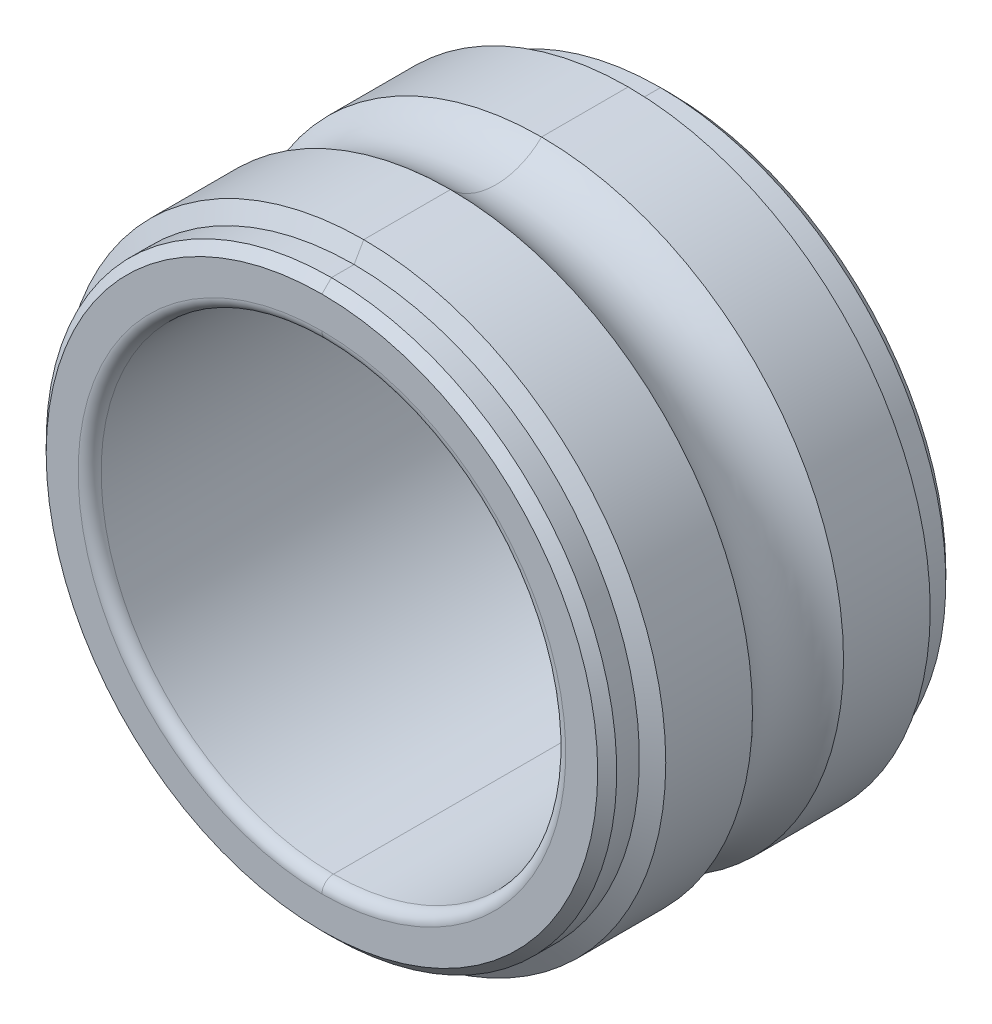
ISO-10303-21;
HEADER;
FILE_DESCRIPTION(('STEP AP214'),'2;1');
FILE_NAME('part.step','',(''),(''),'','','');
FILE_SCHEMA(('AUTOMOTIVE_DESIGN { 1 0 10303 214 1 1 1 1 }'));
ENDSEC;
DATA;
#1=APPLICATION_CONTEXT('core data for automotive mechanical design processes');
#2=APPLICATION_PROTOCOL_DEFINITION('international standard','automotive_design',2000,#1);
#3=PRODUCT_CONTEXT('',#1,'mechanical');
#4=PRODUCT('Part','Part','',(#3));
#5=PRODUCT_RELATED_PRODUCT_CATEGORY('part','',(#4));
#6=PRODUCT_DEFINITION_FORMATION('','',#4);
#7=PRODUCT_DEFINITION_CONTEXT('part definition',#1,'design');
#8=PRODUCT_DEFINITION('design','',#6,#7);
#9=PRODUCT_DEFINITION_SHAPE('','',#8);
#10=(LENGTH_UNIT() NAMED_UNIT(*) SI_UNIT(.MILLI.,.METRE.));
#11=(NAMED_UNIT(*) PLANE_ANGLE_UNIT() SI_UNIT($,.RADIAN.));
#12=(NAMED_UNIT(*) SI_UNIT($,.STERADIAN.) SOLID_ANGLE_UNIT());
#13=UNCERTAINTY_MEASURE_WITH_UNIT(LENGTH_MEASURE(1.E-05),#10,'distance_accuracy_value','');
#14=(GEOMETRIC_REPRESENTATION_CONTEXT(3) GLOBAL_UNCERTAINTY_ASSIGNED_CONTEXT((#13)) GLOBAL_UNIT_ASSIGNED_CONTEXT((#10,
#11,#12)) REPRESENTATION_CONTEXT('',''));
#15=CARTESIAN_POINT('',(0.,0.,0.));
#16=DIRECTION('',(0.,0.,1.));
#17=DIRECTION('',(1.,0.,0.));
#18=AXIS2_PLACEMENT_3D('',#15,#16,#17);
#19=CARTESIAN_POINT('',(0.,0.,1.39954));
#20=DIRECTION('',(0.,0.,-1.));
#21=DIRECTION('',(-0.00244616399090297,-0.999997008136389,0.));
#22=AXIS2_PLACEMENT_3D('',#19,#20,#21);
#23=TOROIDAL_SURFACE('',#22,2.09931,0.09906);
#24=CARTESIAN_POINT('',(0.,-2.09931,1.39954));
#25=DIRECTION('',(-1.,1.30283804578024E-13,0.));
#26=DIRECTION('',(0.,0.,1.));
#27=AXIS2_PLACEMENT_3D('',#24,#25,#26);
#28=CIRCLE('',#27,0.09906);
#29=CARTESIAN_POINT('',(0.,-2.09931,1.4986));
#30=VERTEX_POINT('',#29);
#31=CARTESIAN_POINT('',(0.,-2.00025,1.39954));
#32=VERTEX_POINT('',#31);
#33=EDGE_CURVE('E19',#30,#32,#28,.T.);
#34=ORIENTED_EDGE('',*,*,#33,.F.);
#35=CARTESIAN_POINT('',(0.,0.,1.4986));
#36=DIRECTION('',(0.,0.,1.));
#37=DIRECTION('',(0.,-1.,0.));
#38=AXIS2_PLACEMENT_3D('',#35,#36,#37);
#39=CIRCLE('',#38,2.09931);
#40=CARTESIAN_POINT('',(0.00513525652774209,2.0993037191508,1.4986));
#41=VERTEX_POINT('',#40);
#42=EDGE_CURVE('E166',#30,#41,#39,.T.);
#43=ORIENTED_EDGE('',*,*,#42,.T.);
#44=CARTESIAN_POINT('',(0.,0.,1.4986));
#45=DIRECTION('',(0.,0.,-1.));
#46=DIRECTION('',(0.,1.,0.));
#47=AXIS2_PLACEMENT_3D('',#44,#45,#46);
#48=CIRCLE('',#47,2.09931);
#49=CARTESIAN_POINT('',(0.,2.09931,1.4986));
#50=VERTEX_POINT('',#49);
#51=EDGE_CURVE('E159',#50,#41,#48,.T.);
#52=ORIENTED_EDGE('',*,*,#51,.F.);
#53=CARTESIAN_POINT('',(0.,2.09931,1.39954));
#54=DIRECTION('',(1.,-1.27619269318924E-13,0.));
#55=DIRECTION('',(0.,0.,1.));
#56=AXIS2_PLACEMENT_3D('',#53,#54,#55);
#57=CIRCLE('',#56,0.09906);
#58=CARTESIAN_POINT('',(0.,2.00025,1.39954));
#59=VERTEX_POINT('',#58);
#60=EDGE_CURVE('E11',#50,#59,#57,.T.);
#61=ORIENTED_EDGE('',*,*,#60,.T.);
#62=CARTESIAN_POINT('',(0.,0.,1.39954));
#63=DIRECTION('',(0.,0.,1.));
#64=DIRECTION('',(0.00244616399090244,0.999997008136389,0.));
#65=AXIS2_PLACEMENT_3D('',#62,#63,#64);
#66=CIRCLE('',#65,2.00025);
#67=CARTESIAN_POINT('',(0.00489293952280302,2.00024401552481,1.39954));
#68=VERTEX_POINT('',#67);
#69=EDGE_CURVE('E38',#68,#59,#66,.T.);
#70=ORIENTED_EDGE('',*,*,#69,.F.);
#71=CARTESIAN_POINT('',(0.,0.,1.39954));
#72=DIRECTION('',(0.,0.,1.));
#73=DIRECTION('',(0.,-1.,0.));
#74=AXIS2_PLACEMENT_3D('',#71,#72,#73);
#75=CIRCLE('',#74,2.00025);
#76=EDGE_CURVE('E289',#32,#68,#75,.T.);
#77=ORIENTED_EDGE('',*,*,#76,.F.);
#78=EDGE_LOOP('',(#34,#43,#52,#61,#70,#77));
#79=FACE_BOUND('',#78,.T.);
#80=ADVANCED_FACE('F16',(#79),#23,.T.);
#81=CARTESIAN_POINT('',(0.,0.,1.39954));
#82=DIRECTION('',(0.,0.,-1.));
#83=DIRECTION('',(0.00244616399090297,0.999997008136389,0.));
#84=AXIS2_PLACEMENT_3D('',#81,#82,#83);
#85=TOROIDAL_SURFACE('',#84,2.09931,0.09906);
#86=ORIENTED_EDGE('',*,*,#60,.F.);
#87=CARTESIAN_POINT('',(0.,0.,1.4986));
#88=DIRECTION('',(0.,0.,1.));
#89=DIRECTION('',(0.,1.,0.));
#90=AXIS2_PLACEMENT_3D('',#87,#88,#89);
#91=CIRCLE('',#90,2.09931);
#92=CARTESIAN_POINT('',(-0.00513525652774209,-2.0993037191508,1.4986));
#93=VERTEX_POINT('',#92);
#94=EDGE_CURVE('E153',#50,#93,#91,.T.);
#95=ORIENTED_EDGE('',*,*,#94,.T.);
#96=CARTESIAN_POINT('',(0.,0.,1.4986));
#97=DIRECTION('',(0.,0.,-1.));
#98=DIRECTION('',(0.,-1.,0.));
#99=AXIS2_PLACEMENT_3D('',#96,#97,#98);
#100=CIRCLE('',#99,2.09931);
#101=EDGE_CURVE('E165',#30,#93,#100,.T.);
#102=ORIENTED_EDGE('',*,*,#101,.F.);
#103=ORIENTED_EDGE('',*,*,#33,.T.);
#104=CARTESIAN_POINT('',(0.,0.,1.39954));
#105=DIRECTION('',(0.,0.,1.));
#106=DIRECTION('',(-0.00244616399090269,-0.999997008136389,0.));
#107=AXIS2_PLACEMENT_3D('',#104,#105,#106);
#108=CIRCLE('',#107,2.00025);
#109=CARTESIAN_POINT('',(-0.00489293952280326,-2.00024401552481,1.39954));
#110=VERTEX_POINT('',#109);
#111=EDGE_CURVE('E31',#110,#32,#108,.T.);
#112=ORIENTED_EDGE('',*,*,#111,.F.);
#113=CARTESIAN_POINT('',(0.,0.,1.39954));
#114=DIRECTION('',(0.,0.,1.));
#115=DIRECTION('',(0.,1.,0.));
#116=AXIS2_PLACEMENT_3D('',#113,#114,#115);
#117=CIRCLE('',#116,2.00025);
#118=EDGE_CURVE('E290',#59,#110,#117,.T.);
#119=ORIENTED_EDGE('',*,*,#118,.F.);
#120=EDGE_LOOP('',(#86,#95,#102,#103,#112,#119));
#121=FACE_BOUND('',#120,.T.);
#122=ADVANCED_FACE('F301',(#121),#85,.T.);
#123=CARTESIAN_POINT('',(0.,0.,1.64846));
#124=DIRECTION('',(0.,0.,-1.));
#125=DIRECTION('',(0.,-1.,0.));
#126=AXIS2_PLACEMENT_3D('',#123,#124,#125);
#127=CYLINDRICAL_SURFACE('',#126,2.00025);
#128=DIRECTION('',(0.,0.,1.));
#129=VECTOR('',#128,1.);
#130=CARTESIAN_POINT('',(0.,2.00025,-1.39954));
#131=LINE('',#130,#129);
#132=CARTESIAN_POINT('',(0.,2.00025,-1.39954));
#133=VERTEX_POINT('',#132);
#134=EDGE_CURVE('E281',#133,#59,#131,.T.);
#135=ORIENTED_EDGE('',*,*,#134,.T.);
#136=ORIENTED_EDGE('',*,*,#118,.T.);
#137=ORIENTED_EDGE('',*,*,#111,.T.);
#138=DIRECTION('',(0.,0.,1.));
#139=VECTOR('',#138,1.);
#140=CARTESIAN_POINT('',(0.,-2.00025,-1.39954));
#141=LINE('',#140,#139);
#142=CARTESIAN_POINT('',(0.,-2.00025,-1.39954));
#143=VERTEX_POINT('',#142);
#144=EDGE_CURVE('E286',#143,#32,#141,.T.);
#145=ORIENTED_EDGE('',*,*,#144,.F.);
#146=CARTESIAN_POINT('',(0.,0.,-1.39954));
#147=DIRECTION('',(0.,0.,-1.));
#148=DIRECTION('',(0.,-1.,0.));
#149=AXIS2_PLACEMENT_3D('',#146,#147,#148);
#150=CIRCLE('',#149,2.00025);
#151=CARTESIAN_POINT('',(-0.0072288022953227,-2.00023693769448,-1.39954));
#152=VERTEX_POINT('',#151);
#153=EDGE_CURVE('E270',#143,#152,#150,.T.);
#154=ORIENTED_EDGE('',*,*,#153,.T.);
#155=CARTESIAN_POINT('',(0.,0.,-1.39954));
#156=DIRECTION('',(0.,0.,-1.));
#157=DIRECTION('',(-0.00361394940398572,-0.99999346966353,0.));
#158=AXIS2_PLACEMENT_3D('',#155,#156,#157);
#159=CIRCLE('',#158,2.00025);
#160=EDGE_CURVE('E272',#152,#133,#159,.T.);
#161=ORIENTED_EDGE('',*,*,#160,.T.);
#162=EDGE_LOOP('',(#135,#136,#137,#145,#154,#161));
#163=FACE_BOUND('',#162,.T.);
#164=ADVANCED_FACE('F305',(#163),#127,.F.);
#165=CARTESIAN_POINT('',(0.,0.,1.64846));
#166=DIRECTION('',(0.,0.,-1.));
#167=DIRECTION('',(0.,-1.,0.));
#168=AXIS2_PLACEMENT_3D('',#165,#166,#167);
#169=CYLINDRICAL_SURFACE('',#168,2.00025);
#170=ORIENTED_EDGE('',*,*,#144,.T.);
#171=ORIENTED_EDGE('',*,*,#76,.T.);
#172=ORIENTED_EDGE('',*,*,#69,.T.);
#173=ORIENTED_EDGE('',*,*,#134,.F.);
#174=CARTESIAN_POINT('',(0.,0.,-1.39954));
#175=DIRECTION('',(0.,0.,-1.));
#176=DIRECTION('',(0.,1.,0.));
#177=AXIS2_PLACEMENT_3D('',#174,#175,#176);
#178=CIRCLE('',#177,2.00025);
#179=CARTESIAN_POINT('',(0.00722880229532252,2.00023693769448,-1.39954));
#180=VERTEX_POINT('',#179);
#181=EDGE_CURVE('E276',#133,#180,#178,.T.);
#182=ORIENTED_EDGE('',*,*,#181,.T.);
#183=CARTESIAN_POINT('',(0.,0.,-1.39954));
#184=DIRECTION('',(0.,0.,-1.));
#185=DIRECTION('',(0.00361394940398553,0.99999346966353,0.));
#186=AXIS2_PLACEMENT_3D('',#183,#184,#185);
#187=CIRCLE('',#186,2.00025);
#188=EDGE_CURVE('E278',#180,#143,#187,.T.);
#189=ORIENTED_EDGE('',*,*,#188,.T.);
#190=EDGE_LOOP('',(#170,#171,#172,#173,#182,#189));
#191=FACE_BOUND('',#190,.T.);
#192=ADVANCED_FACE('F309',(#191),#169,.F.);
#193=CARTESIAN_POINT('',(0.,0.,-1.39954));
#194=DIRECTION('',(0.,0.,-1.));
#195=DIRECTION('',(-0.00361394940398611,-0.99999346966353,0.));
#196=AXIS2_PLACEMENT_3D('',#193,#194,#195);
#197=TOROIDAL_SURFACE('',#196,2.09931,0.09906);
#198=CARTESIAN_POINT('',(0.,-2.09931,-1.39954));
#199=DIRECTION('',(-1.,0.,0.));
#200=DIRECTION('',(0.,1.,0.));
#201=AXIS2_PLACEMENT_3D('',#198,#199,#200);
#202=CIRCLE('',#201,0.09906);
#203=CARTESIAN_POINT('',(0.,-2.09931,-1.4986));
#204=VERTEX_POINT('',#203);
#205=EDGE_CURVE('E265',#143,#204,#202,.T.);
#206=ORIENTED_EDGE('',*,*,#205,.F.);
#207=ORIENTED_EDGE('',*,*,#188,.F.);
#208=ORIENTED_EDGE('',*,*,#181,.F.);
#209=CARTESIAN_POINT('',(0.,2.09931,-1.39954));
#210=DIRECTION('',(1.,0.,0.));
#211=DIRECTION('',(0.,-1.,0.));
#212=AXIS2_PLACEMENT_3D('',#209,#210,#211);
#213=CIRCLE('',#212,0.09906);
#214=CARTESIAN_POINT('',(0.,2.09931,-1.4986));
#215=VERTEX_POINT('',#214);
#216=EDGE_CURVE('E274',#133,#215,#213,.T.);
#217=ORIENTED_EDGE('',*,*,#216,.T.);
#218=CARTESIAN_POINT('',(0.,0.,-1.4986));
#219=DIRECTION('',(0.,0.,-1.));
#220=DIRECTION('',(0.,1.,0.));
#221=AXIS2_PLACEMENT_3D('',#218,#219,#220);
#222=CIRCLE('',#221,2.09931);
#223=EDGE_CURVE('E263',#215,#204,#222,.T.);
#224=ORIENTED_EDGE('',*,*,#223,.T.);
#225=EDGE_LOOP('',(#206,#207,#208,#217,#224));
#226=FACE_BOUND('',#225,.T.);
#227=ADVANCED_FACE('F314',(#226),#197,.T.);
#228=CARTESIAN_POINT('',(0.,0.,-1.39954));
#229=DIRECTION('',(0.,0.,-1.));
#230=DIRECTION('',(0.00361394940398611,0.99999346966353,0.));
#231=AXIS2_PLACEMENT_3D('',#228,#229,#230);
#232=TOROIDAL_SURFACE('',#231,2.09931,0.09906);
#233=ORIENTED_EDGE('',*,*,#216,.F.);
#234=ORIENTED_EDGE('',*,*,#160,.F.);
#235=ORIENTED_EDGE('',*,*,#153,.F.);
#236=ORIENTED_EDGE('',*,*,#205,.T.);
#237=CARTESIAN_POINT('',(0.,0.,-1.4986));
#238=DIRECTION('',(0.,0.,-1.));
#239=DIRECTION('',(0.,-1.,0.));
#240=AXIS2_PLACEMENT_3D('',#237,#238,#239);
#241=CIRCLE('',#240,2.09931);
#242=EDGE_CURVE('E260',#204,#215,#241,.T.);
#243=ORIENTED_EDGE('',*,*,#242,.T.);
#244=EDGE_LOOP('',(#233,#234,#235,#236,#243));
#245=FACE_BOUND('',#244,.T.);
#246=ADVANCED_FACE('F319',(#245),#232,.T.);
#247=CARTESIAN_POINT('',(0.,0.,-1.50533908336891));
#248=DIRECTION('',(0.,0.,1.));
#249=DIRECTION('',(0.,1.,0.));
#250=AXIS2_PLACEMENT_3D('',#247,#248,#249);
#251=CONICAL_SURFACE('',#250,2.36769101663109,0.785398163397448);
#252=DIRECTION('',(0.,-0.707106781186547,0.707106781186547));
#253=VECTOR('',#252,1.);
#254=CARTESIAN_POINT('',(0.,-2.3744301,-1.4986));
#255=LINE('',#254,#253);
#256=CARTESIAN_POINT('',(0.,-2.3744301,-1.4986));
#257=VERTEX_POINT('',#256);
#258=CARTESIAN_POINT('',(0.,-2.456307,-1.4167231));
#259=VERTEX_POINT('',#258);
#260=EDGE_CURVE('E249',#257,#259,#255,.T.);
#261=ORIENTED_EDGE('',*,*,#260,.T.);
#262=CARTESIAN_POINT('',(0.,0.,-1.4167231));
#263=DIRECTION('',(0.,0.,1.));
#264=DIRECTION('',(0.,1.,0.));
#265=AXIS2_PLACEMENT_3D('',#262,#263,#264);
#266=CIRCLE('',#265,2.456307);
#267=CARTESIAN_POINT('',(0.,2.456307,-1.4167231));
#268=VERTEX_POINT('',#267);
#269=EDGE_CURVE('E248',#268,#259,#266,.T.);
#270=ORIENTED_EDGE('',*,*,#269,.F.);
#271=DIRECTION('',(0.,0.707106781186547,0.707106781186547));
#272=VECTOR('',#271,1.);
#273=CARTESIAN_POINT('',(0.,2.3744301,-1.4986));
#274=LINE('',#273,#272);
#275=CARTESIAN_POINT('',(0.,2.3744301,-1.4986));
#276=VERTEX_POINT('',#275);
#277=EDGE_CURVE('E251',#276,#268,#274,.T.);
#278=ORIENTED_EDGE('',*,*,#277,.F.);
#279=CARTESIAN_POINT('',(0.,0.,-1.4986));
#280=DIRECTION('',(0.,0.,1.));
#281=DIRECTION('',(0.,1.,0.));
#282=AXIS2_PLACEMENT_3D('',#279,#280,#281);
#283=CIRCLE('',#282,2.3744301);
#284=EDGE_CURVE('E258',#276,#257,#283,.T.);
#285=ORIENTED_EDGE('',*,*,#284,.T.);
#286=EDGE_LOOP('',(#261,#270,#278,#285));
#287=FACE_BOUND('',#286,.T.);
#288=ADVANCED_FACE('F325',(#287),#251,.T.);
#289=CARTESIAN_POINT('',(0.,0.,-1.4986));
#290=DIRECTION('',(0.,0.,-1.));
#291=DIRECTION('',(0.,-1.,0.));
#292=AXIS2_PLACEMENT_3D('',#289,#290,#291);
#293=PLANE('',#292);
#294=ORIENTED_EDGE('',*,*,#223,.F.);
#295=ORIENTED_EDGE('',*,*,#242,.F.);
#296=EDGE_LOOP('',(#294,#295));
#297=FACE_BOUND('',#296,.T.);
#298=ORIENTED_EDGE('',*,*,#284,.F.);
#299=CARTESIAN_POINT('',(0.,0.,-1.4986));
#300=DIRECTION('',(0.,0.,1.));
#301=DIRECTION('',(0.,-1.,0.));
#302=AXIS2_PLACEMENT_3D('',#299,#300,#301);
#303=CIRCLE('',#302,2.3744301);
#304=EDGE_CURVE('E252',#257,#276,#303,.T.);
#305=ORIENTED_EDGE('',*,*,#304,.F.);
#306=EDGE_LOOP('',(#298,#305));
#307=FACE_BOUND('',#306,.T.);
#308=ADVANCED_FACE('F321',(#297,#307),#293,.T.);
#309=CARTESIAN_POINT('',(0.,0.,-1.50533908336891));
#310=DIRECTION('',(0.,0.,1.));
#311=DIRECTION('',(0.,1.,0.));
#312=AXIS2_PLACEMENT_3D('',#309,#310,#311);
#313=CONICAL_SURFACE('',#312,2.36769101663109,0.785398163397448);
#314=ORIENTED_EDGE('',*,*,#277,.T.);
#315=CARTESIAN_POINT('',(0.,0.,-1.4167231));
#316=DIRECTION('',(0.,0.,1.));
#317=DIRECTION('',(0.,-1.,0.));
#318=AXIS2_PLACEMENT_3D('',#315,#316,#317);
#319=CIRCLE('',#318,2.456307);
#320=EDGE_CURVE('E253',#259,#268,#319,.T.);
#321=ORIENTED_EDGE('',*,*,#320,.F.);
#322=ORIENTED_EDGE('',*,*,#260,.F.);
#323=ORIENTED_EDGE('',*,*,#304,.T.);
#324=EDGE_LOOP('',(#314,#321,#322,#323));
#325=FACE_BOUND('',#324,.T.);
#326=ADVANCED_FACE('F324',(#325),#313,.T.);
#327=CARTESIAN_POINT('',(0.,0.,1.64846));
#328=DIRECTION('',(0.,0.,-1.));
#329=DIRECTION('',(0.,-1.,0.));
#330=AXIS2_PLACEMENT_3D('',#327,#328,#329);
#331=CYLINDRICAL_SURFACE('',#330,2.456307);
#332=CARTESIAN_POINT('',(0.,0.,-1.22170383106813));
#333=DIRECTION('',(0.,0.,-1.));
#334=DIRECTION('',(0.,1.,0.));
#335=AXIS2_PLACEMENT_3D('',#332,#333,#334);
#336=CIRCLE('',#335,2.45630699999992);
#337=CARTESIAN_POINT('',(0.,2.45630699999996,-1.2217038310682));
#338=VERTEX_POINT('',#337);
#339=CARTESIAN_POINT('',(0.,-2.45630699999996,-1.2217038310682));
#340=VERTEX_POINT('',#339);
#341=EDGE_CURVE('E232',#338,#340,#336,.T.);
#342=ORIENTED_EDGE('',*,*,#341,.T.);
#343=DIRECTION('',(0.,0.,1.));
#344=VECTOR('',#343,1.);
#345=CARTESIAN_POINT('',(0.,-2.456307,-1.4167231));
#346=LINE('',#345,#344);
#347=EDGE_CURVE('E245',#259,#340,#346,.T.);
#348=ORIENTED_EDGE('',*,*,#347,.F.);
#349=ORIENTED_EDGE('',*,*,#320,.T.);
#350=DIRECTION('',(0.,0.,1.));
#351=VECTOR('',#350,1.);
#352=CARTESIAN_POINT('',(0.,2.456307,-1.4167231));
#353=LINE('',#352,#351);
#354=EDGE_CURVE('E241',#268,#338,#353,.T.);
#355=ORIENTED_EDGE('',*,*,#354,.T.);
#356=EDGE_LOOP('',(#342,#348,#349,#355));
#357=FACE_BOUND('',#356,.T.);
#358=ADVANCED_FACE('F340',(#357),#331,.T.);
#359=CARTESIAN_POINT('',(0.,0.,1.64846));
#360=DIRECTION('',(0.,0.,-1.));
#361=DIRECTION('',(0.,-1.,0.));
#362=AXIS2_PLACEMENT_3D('',#359,#360,#361);
#363=CYLINDRICAL_SURFACE('',#362,2.456307);
#364=ORIENTED_EDGE('',*,*,#269,.T.);
#365=ORIENTED_EDGE('',*,*,#347,.T.);
#366=CARTESIAN_POINT('',(0.,0.,-1.22170383106813));
#367=DIRECTION('',(0.,0.,-1.));
#368=DIRECTION('',(0.,-1.,0.));
#369=AXIS2_PLACEMENT_3D('',#366,#367,#368);
#370=CIRCLE('',#369,2.45630699999992);
#371=EDGE_CURVE('E236',#340,#338,#370,.T.);
#372=ORIENTED_EDGE('',*,*,#371,.T.);
#373=ORIENTED_EDGE('',*,*,#354,.F.);
#374=EDGE_LOOP('',(#364,#365,#372,#373));
#375=FACE_BOUND('',#374,.T.);
#376=ADVANCED_FACE('F336',(#375),#363,.T.);
#377=CARTESIAN_POINT('',(0.,0.,-1.22646908261727));
#378=DIRECTION('',(0.,0.,1.));
#379=DIRECTION('',(0.,1.,0.));
#380=AXIS2_PLACEMENT_3D('',#377,#378,#379);
#381=CONICAL_SURFACE('',#380,2.44805334220596,1.0471975511966);
#382=DIRECTION('',(0.,0.866025403784439,0.5));
#383=VECTOR('',#382,1.);
#384=CARTESIAN_POINT('',(0.,2.45630699999992,-1.22170383106813));
#385=LINE('',#384,#383);
#386=CARTESIAN_POINT('',(0.,2.60032499999999,-1.13855499999998));
#387=VERTEX_POINT('',#386);
#388=EDGE_CURVE('E231',#338,#387,#385,.T.);
#389=ORIENTED_EDGE('',*,*,#388,.F.);
#390=ORIENTED_EDGE('',*,*,#371,.F.);
#391=DIRECTION('',(0.,-0.866025403784439,0.5));
#392=VECTOR('',#391,1.);
#393=CARTESIAN_POINT('',(0.,-2.45630699999992,-1.22170383106813));
#394=LINE('',#393,#392);
#395=CARTESIAN_POINT('',(0.,-2.60032499999998,-1.13855499999998));
#396=VERTEX_POINT('',#395);
#397=EDGE_CURVE('E234',#340,#396,#394,.T.);
#398=ORIENTED_EDGE('',*,*,#397,.T.);
#399=CARTESIAN_POINT('',(0.,0.,-1.13855499999995));
#400=DIRECTION('',(0.,0.,1.));
#401=DIRECTION('',(0.,1.,0.));
#402=AXIS2_PLACEMENT_3D('',#399,#400,#401);
#403=CIRCLE('',#402,2.60032499999997);
#404=EDGE_CURVE('E224',#387,#396,#403,.T.);
#405=ORIENTED_EDGE('',*,*,#404,.F.);
#406=EDGE_LOOP('',(#389,#390,#398,#405));
#407=FACE_BOUND('',#406,.T.);
#408=ADVANCED_FACE('F347',(#407),#381,.T.);
#409=CARTESIAN_POINT('',(0.,0.,-1.22646908261727));
#410=DIRECTION('',(0.,0.,1.));
#411=DIRECTION('',(0.,1.,0.));
#412=AXIS2_PLACEMENT_3D('',#409,#410,#411);
#413=CONICAL_SURFACE('',#412,2.44805334220596,1.0471975511966);
#414=ORIENTED_EDGE('',*,*,#397,.F.);
#415=ORIENTED_EDGE('',*,*,#341,.F.);
#416=ORIENTED_EDGE('',*,*,#388,.T.);
#417=CARTESIAN_POINT('',(0.,0.,-1.13855499999995));
#418=DIRECTION('',(0.,0.,1.));
#419=DIRECTION('',(0.,-1.,0.));
#420=AXIS2_PLACEMENT_3D('',#417,#418,#419);
#421=CIRCLE('',#420,2.60032499999997);
#422=EDGE_CURVE('E228',#396,#387,#421,.T.);
#423=ORIENTED_EDGE('',*,*,#422,.F.);
#424=EDGE_LOOP('',(#414,#415,#416,#423));
#425=FACE_BOUND('',#424,.T.);
#426=ADVANCED_FACE('F344',(#425),#413,.T.);
#427=CARTESIAN_POINT('',(0.,0.,1.64846));
#428=DIRECTION('',(0.,0.,-1.));
#429=DIRECTION('',(0.,-1.,0.));
#430=AXIS2_PLACEMENT_3D('',#427,#428,#429);
#431=CYLINDRICAL_SURFACE('',#430,2.600325);
#432=DIRECTION('',(0.,0.,-1.));
#433=VECTOR('',#432,1.);
#434=CARTESIAN_POINT('',(0.,-2.600325,-0.391967348640062));
#435=LINE('',#434,#433);
#436=CARTESIAN_POINT('',(0.,-2.60032499999997,-0.391967348640087));
#437=VERTEX_POINT('',#436);
#438=EDGE_CURVE('E217',#437,#396,#435,.T.);
#439=ORIENTED_EDGE('',*,*,#438,.T.);
#440=ORIENTED_EDGE('',*,*,#422,.T.);
#441=DIRECTION('',(0.,0.,-1.));
#442=VECTOR('',#441,1.);
#443=CARTESIAN_POINT('',(0.,2.600325,-0.391967348640062));
#444=LINE('',#443,#442);
#445=CARTESIAN_POINT('',(0.,2.60032499999997,-0.391967348640087));
#446=VERTEX_POINT('',#445);
#447=EDGE_CURVE('E225',#446,#387,#444,.T.);
#448=ORIENTED_EDGE('',*,*,#447,.F.);
#449=CARTESIAN_POINT('',(0.,0.,-0.391967348640111));
#450=DIRECTION('',(0.,0.,-1.));
#451=DIRECTION('',(0.,1.,0.));
#452=AXIS2_PLACEMENT_3D('',#449,#450,#451);
#453=CIRCLE('',#452,2.60032499999995);
#454=EDGE_CURVE('E192',#446,#437,#453,.T.);
#455=ORIENTED_EDGE('',*,*,#454,.T.);
#456=EDGE_LOOP('',(#439,#440,#448,#455));
#457=FACE_BOUND('',#456,.T.);
#458=ADVANCED_FACE('F354',(#457),#431,.T.);
#459=CARTESIAN_POINT('',(0.,0.,1.64846));
#460=DIRECTION('',(0.,0.,-1.));
#461=DIRECTION('',(0.,-1.,0.));
#462=AXIS2_PLACEMENT_3D('',#459,#460,#461);
#463=CYLINDRICAL_SURFACE('',#462,2.600325);
#464=ORIENTED_EDGE('',*,*,#447,.T.);
#465=ORIENTED_EDGE('',*,*,#404,.T.);
#466=ORIENTED_EDGE('',*,*,#438,.F.);
#467=CARTESIAN_POINT('',(0.,0.,-0.391967348640111));
#468=DIRECTION('',(0.,0.,-1.));
#469=DIRECTION('',(0.,-1.,0.));
#470=AXIS2_PLACEMENT_3D('',#467,#468,#469);
#471=CIRCLE('',#470,2.60032499999995);
#472=EDGE_CURVE('E209',#437,#446,#471,.T.);
#473=ORIENTED_EDGE('',*,*,#472,.T.);
#474=EDGE_LOOP('',(#464,#465,#466,#473));
#475=FACE_BOUND('',#474,.T.);
#476=ADVANCED_FACE('F350',(#475),#463,.T.);
#477=CARTESIAN_POINT('',(0.,0.,1.22646908261727));
#478=DIRECTION('',(0.,0.,-1.));
#479=DIRECTION('',(0.,-1.,0.));
#480=AXIS2_PLACEMENT_3D('',#477,#478,#479);
#481=CONICAL_SURFACE('',#480,2.44805334220596,1.0471975511966);
#482=DIRECTION('',(0.,0.866025403784439,0.5));
#483=VECTOR('',#482,1.);
#484=CARTESIAN_POINT('',(0.,-2.60032499999997,1.13855499999995));
#485=LINE('',#484,#483);
#486=CARTESIAN_POINT('',(0.,-2.60032499999999,1.13855499999998));
#487=VERTEX_POINT('',#486);
#488=CARTESIAN_POINT('',(0.,-2.45630699999996,1.2217038310682));
#489=VERTEX_POINT('',#488);
#490=EDGE_CURVE('E182',#487,#489,#485,.T.);
#491=ORIENTED_EDGE('',*,*,#490,.T.);
#492=CARTESIAN_POINT('',(0.,0.,1.22170383106813));
#493=DIRECTION('',(0.,0.,1.));
#494=DIRECTION('',(0.,1.,0.));
#495=AXIS2_PLACEMENT_3D('',#492,#493,#494);
#496=CIRCLE('',#495,2.45630699999992);
#497=CARTESIAN_POINT('',(0.,2.45630699999996,1.2217038310682));
#498=VERTEX_POINT('',#497);
#499=EDGE_CURVE('E178',#498,#489,#496,.T.);
#500=ORIENTED_EDGE('',*,*,#499,.F.);
#501=DIRECTION('',(0.,-0.866025403784439,0.5));
#502=VECTOR('',#501,1.);
#503=CARTESIAN_POINT('',(0.,2.60032499999997,1.13855499999995));
#504=LINE('',#503,#502);
#505=CARTESIAN_POINT('',(0.,2.60032499999998,1.13855499999998));
#506=VERTEX_POINT('',#505);
#507=EDGE_CURVE('E185',#506,#498,#504,.T.);
#508=ORIENTED_EDGE('',*,*,#507,.F.);
#509=CARTESIAN_POINT('',(0.,0.,1.13855499999995));
#510=DIRECTION('',(0.,0.,-1.));
#511=DIRECTION('',(0.,-1.,0.));
#512=AXIS2_PLACEMENT_3D('',#509,#510,#511);
#513=CIRCLE('',#512,2.60032499999997);
#514=EDGE_CURVE('E212',#487,#506,#513,.T.);
#515=ORIENTED_EDGE('',*,*,#514,.F.);
#516=EDGE_LOOP('',(#491,#500,#508,#515));
#517=FACE_BOUND('',#516,.T.);
#518=ADVANCED_FACE('F373',(#517),#481,.T.);
#519=CARTESIAN_POINT('',(0.,0.,1.64846));
#520=DIRECTION('',(0.,0.,-1.));
#521=DIRECTION('',(0.,-1.,0.));
#522=AXIS2_PLACEMENT_3D('',#519,#520,#521);
#523=CYLINDRICAL_SURFACE('',#522,2.600325);
#524=DIRECTION('',(0.,0.,-1.));
#525=VECTOR('',#524,1.);
#526=CARTESIAN_POINT('',(0.,-2.600325,1.138555));
#527=LINE('',#526,#525);
#528=CARTESIAN_POINT('',(0.,-2.60032499999997,0.391967348640087));
#529=VERTEX_POINT('',#528);
#530=EDGE_CURVE('E191',#487,#529,#527,.T.);
#531=ORIENTED_EDGE('',*,*,#530,.F.);
#532=ORIENTED_EDGE('',*,*,#514,.T.);
#533=DIRECTION('',(0.,0.,-1.));
#534=VECTOR('',#533,1.);
#535=CARTESIAN_POINT('',(0.,2.600325,1.138555));
#536=LINE('',#535,#534);
#537=CARTESIAN_POINT('',(0.,2.60032499999997,0.391967348640087));
#538=VERTEX_POINT('',#537);
#539=EDGE_CURVE('E188',#506,#538,#536,.T.);
#540=ORIENTED_EDGE('',*,*,#539,.T.);
#541=CARTESIAN_POINT('',(0.,0.,0.391967348640111));
#542=DIRECTION('',(0.,0.,1.));
#543=DIRECTION('',(0.,1.,0.));
#544=AXIS2_PLACEMENT_3D('',#541,#542,#543);
#545=CIRCLE('',#544,2.60032499999995);
#546=EDGE_CURVE('E200',#538,#529,#545,.T.);
#547=ORIENTED_EDGE('',*,*,#546,.T.);
#548=EDGE_LOOP('',(#531,#532,#540,#547));
#549=FACE_BOUND('',#548,.T.);
#550=ADVANCED_FACE('F371',(#549),#523,.T.);
#551=CARTESIAN_POINT('',(0.,0.,0.));
#552=DIRECTION('',(0.,0.,-1.));
#553=DIRECTION('',(0.,-1.,0.));
#554=AXIS2_PLACEMENT_3D('',#551,#552,#553);
#555=TOROIDAL_SURFACE('',#554,3.000375,0.56007);
#556=ORIENTED_EDGE('',*,*,#472,.F.);
#557=CARTESIAN_POINT('',(0.,-3.000375,0.));
#558=DIRECTION('',(1.,0.,0.));
#559=DIRECTION('',(0.,0.714285714285807,-0.699854212223671));
#560=AXIS2_PLACEMENT_3D('',#557,#558,#559);
#561=CIRCLE('',#560,0.56007);
#562=CARTESIAN_POINT('',(0.,-2.440305,0.));
#563=VERTEX_POINT('',#562);
#564=EDGE_CURVE('E194',#437,#563,#561,.T.);
#565=ORIENTED_EDGE('',*,*,#564,.T.);
#566=CARTESIAN_POINT('',(0.,-3.000375,0.));
#567=DIRECTION('',(1.,0.,0.));
#568=DIRECTION('',(0.,1.,0.));
#569=AXIS2_PLACEMENT_3D('',#566,#567,#568);
#570=CIRCLE('',#569,0.56007);
#571=EDGE_CURVE('E197',#563,#529,#570,.T.);
#572=ORIENTED_EDGE('',*,*,#571,.T.);
#573=ORIENTED_EDGE('',*,*,#546,.F.);
#574=CARTESIAN_POINT('',(0.,3.000375,0.));
#575=DIRECTION('',(-1.,0.,0.));
#576=DIRECTION('',(0.,-1.,0.));
#577=AXIS2_PLACEMENT_3D('',#574,#575,#576);
#578=CIRCLE('',#577,0.56007);
#579=CARTESIAN_POINT('',(0.,2.440305,0.));
#580=VERTEX_POINT('',#579);
#581=EDGE_CURVE('E190',#580,#538,#578,.T.);
#582=ORIENTED_EDGE('',*,*,#581,.F.);
#583=CARTESIAN_POINT('',(0.,3.000375,0.));
#584=DIRECTION('',(-1.,0.,0.));
#585=DIRECTION('',(0.,-0.714285714285807,-0.699854212223671));
#586=AXIS2_PLACEMENT_3D('',#583,#584,#585);
#587=CIRCLE('',#586,0.56007);
#588=EDGE_CURVE('E195',#446,#580,#587,.T.);
#589=ORIENTED_EDGE('',*,*,#588,.F.);
#590=EDGE_LOOP('',(#556,#565,#572,#573,#582,#589));
#591=FACE_BOUND('',#590,.T.);
#592=ADVANCED_FACE('F362',(#591),#555,.F.);
#593=CARTESIAN_POINT('',(0.,0.,0.));
#594=DIRECTION('',(0.,0.,-1.));
#595=DIRECTION('',(0.,-1.,0.));
#596=AXIS2_PLACEMENT_3D('',#593,#594,#595);
#597=TOROIDAL_SURFACE('',#596,3.000375,0.56007);
#598=CARTESIAN_POINT('',(0.,0.,0.391967348640111));
#599=DIRECTION('',(0.,0.,1.));
#600=DIRECTION('',(0.,-1.,0.));
#601=AXIS2_PLACEMENT_3D('',#598,#599,#600);
#602=CIRCLE('',#601,2.60032499999995);
#603=EDGE_CURVE('E201',#529,#538,#602,.T.);
#604=ORIENTED_EDGE('',*,*,#603,.F.);
#605=ORIENTED_EDGE('',*,*,#571,.F.);
#606=ORIENTED_EDGE('',*,*,#564,.F.);
#607=ORIENTED_EDGE('',*,*,#454,.F.);
#608=ORIENTED_EDGE('',*,*,#588,.T.);
#609=ORIENTED_EDGE('',*,*,#581,.T.);
#610=EDGE_LOOP('',(#604,#605,#606,#607,#608,#609));
#611=FACE_BOUND('',#610,.T.);
#612=ADVANCED_FACE('F359',(#611),#597,.F.);
#613=CARTESIAN_POINT('',(0.,0.,1.64846));
#614=DIRECTION('',(0.,0.,-1.));
#615=DIRECTION('',(0.,-1.,0.));
#616=AXIS2_PLACEMENT_3D('',#613,#614,#615);
#617=CYLINDRICAL_SURFACE('',#616,2.600325);
#618=ORIENTED_EDGE('',*,*,#539,.F.);
#619=CARTESIAN_POINT('',(0.,0.,1.13855499999995));
#620=DIRECTION('',(0.,0.,-1.));
#621=DIRECTION('',(0.,1.,0.));
#622=AXIS2_PLACEMENT_3D('',#619,#620,#621);
#623=CIRCLE('',#622,2.60032499999997);
#624=EDGE_CURVE('E179',#506,#487,#623,.T.);
#625=ORIENTED_EDGE('',*,*,#624,.T.);
#626=ORIENTED_EDGE('',*,*,#530,.T.);
#627=ORIENTED_EDGE('',*,*,#603,.T.);
#628=EDGE_LOOP('',(#618,#625,#626,#627));
#629=FACE_BOUND('',#628,.T.);
#630=ADVANCED_FACE('F366',(#629),#617,.T.);
#631=CARTESIAN_POINT('',(0.,0.,1.22646908261727));
#632=DIRECTION('',(0.,0.,-1.));
#633=DIRECTION('',(0.,-1.,0.));
#634=AXIS2_PLACEMENT_3D('',#631,#632,#633);
#635=CONICAL_SURFACE('',#634,2.44805334220596,1.0471975511966);
#636=ORIENTED_EDGE('',*,*,#507,.T.);
#637=CARTESIAN_POINT('',(0.,0.,1.22170383106813));
#638=DIRECTION('',(0.,0.,1.));
#639=DIRECTION('',(0.,-1.,0.));
#640=AXIS2_PLACEMENT_3D('',#637,#638,#639);
#641=CIRCLE('',#640,2.45630699999992);
#642=EDGE_CURVE('E183',#489,#498,#641,.T.);
#643=ORIENTED_EDGE('',*,*,#642,.F.);
#644=ORIENTED_EDGE('',*,*,#490,.F.);
#645=ORIENTED_EDGE('',*,*,#624,.F.);
#646=EDGE_LOOP('',(#636,#643,#644,#645));
#647=FACE_BOUND('',#646,.T.);
#648=ADVANCED_FACE('F376',(#647),#635,.T.);
#649=CARTESIAN_POINT('',(0.,0.,1.64846));
#650=DIRECTION('',(0.,0.,-1.));
#651=DIRECTION('',(0.,-1.,0.));
#652=AXIS2_PLACEMENT_3D('',#649,#650,#651);
#653=CYLINDRICAL_SURFACE('',#652,2.456307);
#654=CARTESIAN_POINT('',(0.,0.,1.4167231));
#655=DIRECTION('',(0.,0.,-1.));
#656=DIRECTION('',(0.,1.,0.));
#657=AXIS2_PLACEMENT_3D('',#654,#655,#656);
#658=CIRCLE('',#657,2.456307);
#659=CARTESIAN_POINT('',(0.,2.456307,1.4167231));
#660=VERTEX_POINT('',#659);
#661=CARTESIAN_POINT('',(0.,-2.456307,1.4167231));
#662=VERTEX_POINT('',#661);
#663=EDGE_CURVE('E158',#660,#662,#658,.T.);
#664=ORIENTED_EDGE('',*,*,#663,.T.);
#665=DIRECTION('',(0.,0.,1.));
#666=VECTOR('',#665,1.);
#667=CARTESIAN_POINT('',(0.,-2.456307,1.22170383106827));
#668=LINE('',#667,#666);
#669=EDGE_CURVE('E175',#489,#662,#668,.T.);
#670=ORIENTED_EDGE('',*,*,#669,.F.);
#671=ORIENTED_EDGE('',*,*,#642,.T.);
#672=DIRECTION('',(0.,0.,1.));
#673=VECTOR('',#672,1.);
#674=CARTESIAN_POINT('',(0.,2.456307,1.22170383106827));
#675=LINE('',#674,#673);
#676=EDGE_CURVE('E172',#498,#660,#675,.T.);
#677=ORIENTED_EDGE('',*,*,#676,.T.);
#678=EDGE_LOOP('',(#664,#670,#671,#677));
#679=FACE_BOUND('',#678,.T.);
#680=ADVANCED_FACE('F380',(#679),#653,.T.);
#681=CARTESIAN_POINT('',(0.,0.,1.64846));
#682=DIRECTION('',(0.,0.,-1.));
#683=DIRECTION('',(0.,-1.,0.));
#684=AXIS2_PLACEMENT_3D('',#681,#682,#683);
#685=CYLINDRICAL_SURFACE('',#684,2.456307);
#686=ORIENTED_EDGE('',*,*,#499,.T.);
#687=ORIENTED_EDGE('',*,*,#669,.T.);
#688=CARTESIAN_POINT('',(0.,0.,1.4167231));
#689=DIRECTION('',(0.,0.,-1.));
#690=DIRECTION('',(0.,-1.,0.));
#691=AXIS2_PLACEMENT_3D('',#688,#689,#690);
#692=CIRCLE('',#691,2.456307);
#693=EDGE_CURVE('E170',#662,#660,#692,.T.);
#694=ORIENTED_EDGE('',*,*,#693,.T.);
#695=ORIENTED_EDGE('',*,*,#676,.F.);
#696=EDGE_LOOP('',(#686,#687,#694,#695));
#697=FACE_BOUND('',#696,.T.);
#698=ADVANCED_FACE('F382',(#697),#685,.T.);
#699=CARTESIAN_POINT('',(0.,0.,1.50533908336891));
#700=DIRECTION('',(0.,0.,-1.));
#701=DIRECTION('',(0.,-1.,0.));
#702=AXIS2_PLACEMENT_3D('',#699,#700,#701);
#703=CONICAL_SURFACE('',#702,2.36769101663109,0.785398163397448);
#704=DIRECTION('',(0.,-0.707106781186547,0.707106781186547));
#705=VECTOR('',#704,1.);
#706=CARTESIAN_POINT('',(0.,2.456307,1.4167231));
#707=LINE('',#706,#705);
#708=CARTESIAN_POINT('',(0.,2.3744301,1.4986));
#709=VERTEX_POINT('',#708);
#710=EDGE_CURVE('E146',#660,#709,#707,.T.);
#711=ORIENTED_EDGE('',*,*,#710,.F.);
#712=ORIENTED_EDGE('',*,*,#693,.F.);
#713=DIRECTION('',(0.,0.707106781186547,0.707106781186547));
#714=VECTOR('',#713,1.);
#715=CARTESIAN_POINT('',(0.,-2.456307,1.4167231));
#716=LINE('',#715,#714);
#717=CARTESIAN_POINT('',(0.,-2.3744301,1.4986));
#718=VERTEX_POINT('',#717);
#719=EDGE_CURVE('E149',#662,#718,#716,.T.);
#720=ORIENTED_EDGE('',*,*,#719,.T.);
#721=CARTESIAN_POINT('',(0.,0.,1.4986));
#722=DIRECTION('',(0.,0.,-1.));
#723=DIRECTION('',(0.,-1.,0.));
#724=AXIS2_PLACEMENT_3D('',#721,#722,#723);
#725=CIRCLE('',#724,2.3744301);
#726=EDGE_CURVE('E142',#718,#709,#725,.T.);
#727=ORIENTED_EDGE('',*,*,#726,.T.);
#728=EDGE_LOOP('',(#711,#712,#720,#727));
#729=FACE_BOUND('',#728,.T.);
#730=ADVANCED_FACE('F144',(#729),#703,.T.);
#731=CARTESIAN_POINT('',(0.,0.,1.50533908336891));
#732=DIRECTION('',(0.,0.,-1.));
#733=DIRECTION('',(0.,-1.,0.));
#734=AXIS2_PLACEMENT_3D('',#731,#732,#733);
#735=CONICAL_SURFACE('',#734,2.36769101663109,0.785398163397448);
#736=ORIENTED_EDGE('',*,*,#719,.F.);
#737=ORIENTED_EDGE('',*,*,#663,.F.);
#738=ORIENTED_EDGE('',*,*,#710,.T.);
#739=CARTESIAN_POINT('',(0.,0.,1.4986));
#740=DIRECTION('',(0.,0.,-1.));
#741=DIRECTION('',(0.,1.,0.));
#742=AXIS2_PLACEMENT_3D('',#739,#740,#741);
#743=CIRCLE('',#742,2.3744301);
#744=EDGE_CURVE('E154',#709,#718,#743,.T.);
#745=ORIENTED_EDGE('',*,*,#744,.T.);
#746=EDGE_LOOP('',(#736,#737,#738,#745));
#747=FACE_BOUND('',#746,.T.);
#748=ADVANCED_FACE('F157',(#747),#735,.T.);
#749=CARTESIAN_POINT('',(0.,0.,1.4986));
#750=DIRECTION('',(0.,0.,-1.));
#751=DIRECTION('',(0.,-1.,0.));
#752=AXIS2_PLACEMENT_3D('',#749,#750,#751);
#753=PLANE('',#752);
#754=ORIENTED_EDGE('',*,*,#51,.T.);
#755=ORIENTED_EDGE('',*,*,#42,.F.);
#756=ORIENTED_EDGE('',*,*,#101,.T.);
#757=ORIENTED_EDGE('',*,*,#94,.F.);
#758=EDGE_LOOP('',(#754,#755,#756,#757));
#759=FACE_BOUND('',#758,.T.);
#760=ORIENTED_EDGE('',*,*,#726,.F.);
#761=ORIENTED_EDGE('',*,*,#744,.F.);
#762=EDGE_LOOP('',(#760,#761));
#763=FACE_BOUND('',#762,.T.);
#764=ADVANCED_FACE('F161',(#759,#763),#753,.F.);
#765=CLOSED_SHELL('',(#80,#122,#164,#192,#227,#246,#288,#308,#326,#358,#376,#408,#426,#458,#476,
#518,#550,#592,#612,#630,#648,#680,#698,#730,#748,#764));
#766=MANIFOLD_SOLID_BREP('B1',#765);
#767=ADVANCED_BREP_SHAPE_REPRESENTATION('',(#18,#766),#14);
#768=SHAPE_DEFINITION_REPRESENTATION(#9,#767);
ENDSEC;
END-ISO-10303-21;
